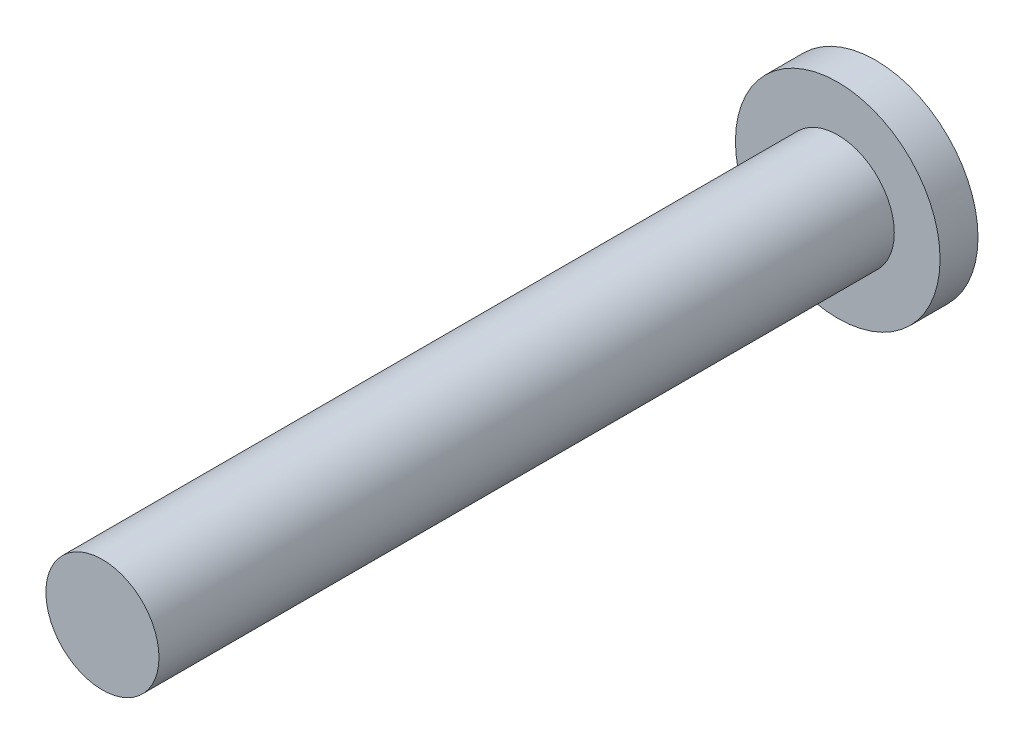
ISO-10303-21;
HEADER;
FILE_DESCRIPTION(('STEP AP214'),'2;1');
FILE_NAME('part.step','',(''),(''),'','','');
FILE_SCHEMA(('AUTOMOTIVE_DESIGN { 1 0 10303 214 1 1 1 1 }'));
ENDSEC;
DATA;
#1=APPLICATION_CONTEXT('core data for automotive mechanical design processes');
#2=APPLICATION_PROTOCOL_DEFINITION('international standard','automotive_design',2000,#1);
#3=PRODUCT_CONTEXT('',#1,'mechanical');
#4=PRODUCT('Part','Part','',(#3));
#5=PRODUCT_RELATED_PRODUCT_CATEGORY('part','',(#4));
#6=PRODUCT_DEFINITION_FORMATION('','',#4);
#7=PRODUCT_DEFINITION_CONTEXT('part definition',#1,'design');
#8=PRODUCT_DEFINITION('design','',#6,#7);
#9=PRODUCT_DEFINITION_SHAPE('','',#8);
#10=(LENGTH_UNIT() NAMED_UNIT(*) SI_UNIT(.MILLI.,.METRE.));
#11=(NAMED_UNIT(*) PLANE_ANGLE_UNIT() SI_UNIT($,.RADIAN.));
#12=(NAMED_UNIT(*) SI_UNIT($,.STERADIAN.) SOLID_ANGLE_UNIT());
#13=UNCERTAINTY_MEASURE_WITH_UNIT(LENGTH_MEASURE(1.E-05),#10,'distance_accuracy_value','');
#14=(GEOMETRIC_REPRESENTATION_CONTEXT(3) GLOBAL_UNCERTAINTY_ASSIGNED_CONTEXT((#13)) GLOBAL_UNIT_ASSIGNED_CONTEXT((#10,
#11,#12)) REPRESENTATION_CONTEXT('',''));
#15=CARTESIAN_POINT('',(0.,0.,0.));
#16=DIRECTION('',(0.,0.,1.));
#17=DIRECTION('',(1.,0.,0.));
#18=AXIS2_PLACEMENT_3D('',#15,#16,#17);
#19=CARTESIAN_POINT('',(0.,0.,1.64));
#20=DIRECTION('',(0.,0.,-1.));
#21=DIRECTION('',(-1.,0.,0.));
#22=AXIS2_PLACEMENT_3D('',#19,#20,#21);
#23=CYLINDRICAL_SURFACE('',#22,4.425);
#24=CARTESIAN_POINT('',(0.,0.,1.64));
#25=DIRECTION('',(0.,0.,1.));
#26=DIRECTION('',(1.,0.,0.));
#27=AXIS2_PLACEMENT_3D('',#24,#25,#26);
#28=CIRCLE('',#27,4.425);
#29=CARTESIAN_POINT('',(4.425,0.,1.64));
#30=VERTEX_POINT('',#29);
#31=EDGE_CURVE('E39',#30,#30,#28,.T.);
#32=ORIENTED_EDGE('',*,*,#31,.F.);
#33=EDGE_LOOP('',(#32));
#34=FACE_BOUND('',#33,.T.);
#35=CARTESIAN_POINT('',(0.,0.,0.));
#36=DIRECTION('',(0.,0.,1.));
#37=DIRECTION('',(1.,0.,0.));
#38=AXIS2_PLACEMENT_3D('',#35,#36,#37);
#39=CIRCLE('',#38,4.425);
#40=CARTESIAN_POINT('',(4.425,0.,0.));
#41=VERTEX_POINT('',#40);
#42=EDGE_CURVE('E35',#41,#41,#39,.T.);
#43=ORIENTED_EDGE('',*,*,#42,.T.);
#44=EDGE_LOOP('',(#43));
#45=FACE_BOUND('',#44,.T.);
#46=ADVANCED_FACE('F32',(#34,#45),#23,.T.);
#47=CARTESIAN_POINT('',(0.,0.,1.64));
#48=DIRECTION('',(0.,0.,1.));
#49=DIRECTION('',(1.,0.,0.));
#50=AXIS2_PLACEMENT_3D('',#47,#48,#49);
#51=PLANE('',#50);
#52=CARTESIAN_POINT('',(0.,0.,1.64));
#53=DIRECTION('',(0.,0.,1.));
#54=DIRECTION('',(1.,0.,0.));
#55=AXIS2_PLACEMENT_3D('',#52,#53,#54);
#56=CIRCLE('',#55,2.445);
#57=CARTESIAN_POINT('',(2.445,0.,1.64));
#58=VERTEX_POINT('',#57);
#59=EDGE_CURVE('E10',#58,#58,#56,.T.);
#60=ORIENTED_EDGE('',*,*,#59,.F.);
#61=EDGE_LOOP('',(#60));
#62=FACE_BOUND('',#61,.T.);
#63=ORIENTED_EDGE('',*,*,#31,.T.);
#64=EDGE_LOOP('',(#63));
#65=FACE_BOUND('',#64,.T.);
#66=ADVANCED_FACE('F56',(#62,#65),#51,.T.);
#67=CARTESIAN_POINT('',(0.,0.,0.));
#68=DIRECTION('',(0.,0.,1.));
#69=DIRECTION('',(1.,0.,0.));
#70=AXIS2_PLACEMENT_3D('',#67,#68,#69);
#71=PLANE('',#70);
#72=ORIENTED_EDGE('',*,*,#42,.F.);
#73=EDGE_LOOP('',(#72));
#74=FACE_BOUND('',#73,.T.);
#75=ADVANCED_FACE('F53',(#74),#71,.F.);
#76=CARTESIAN_POINT('',(0.,0.,33.44));
#77=DIRECTION('',(0.,0.,-1.));
#78=DIRECTION('',(-1.,0.,0.));
#79=AXIS2_PLACEMENT_3D('',#76,#77,#78);
#80=CYLINDRICAL_SURFACE('',#79,2.445);
#81=CARTESIAN_POINT('',(0.,0.,33.44));
#82=DIRECTION('',(0.,0.,1.));
#83=DIRECTION('',(1.,0.,0.));
#84=AXIS2_PLACEMENT_3D('',#81,#82,#83);
#85=CIRCLE('',#84,2.445);
#86=CARTESIAN_POINT('',(2.445,0.,33.44));
#87=VERTEX_POINT('',#86);
#88=EDGE_CURVE('E45',#87,#87,#85,.T.);
#89=ORIENTED_EDGE('',*,*,#88,.F.);
#90=EDGE_LOOP('',(#89));
#91=FACE_BOUND('',#90,.T.);
#92=ORIENTED_EDGE('',*,*,#59,.T.);
#93=EDGE_LOOP('',(#92));
#94=FACE_BOUND('',#93,.T.);
#95=ADVANCED_FACE('F55',(#91,#94),#80,.T.);
#96=CARTESIAN_POINT('',(0.,0.,33.44));
#97=DIRECTION('',(0.,0.,1.));
#98=DIRECTION('',(1.,0.,0.));
#99=AXIS2_PLACEMENT_3D('',#96,#97,#98);
#100=PLANE('',#99);
#101=ORIENTED_EDGE('',*,*,#88,.T.);
#102=EDGE_LOOP('',(#101));
#103=FACE_BOUND('',#102,.T.);
#104=ADVANCED_FACE('F61',(#103),#100,.T.);
#105=CLOSED_SHELL('',(#46,#66,#75,#95,#104));
#106=MANIFOLD_SOLID_BREP('B2',#105);
#107=ADVANCED_BREP_SHAPE_REPRESENTATION('',(#18,#106),#14);
#108=SHAPE_DEFINITION_REPRESENTATION(#9,#107);
ENDSEC;
END-ISO-10303-21;
